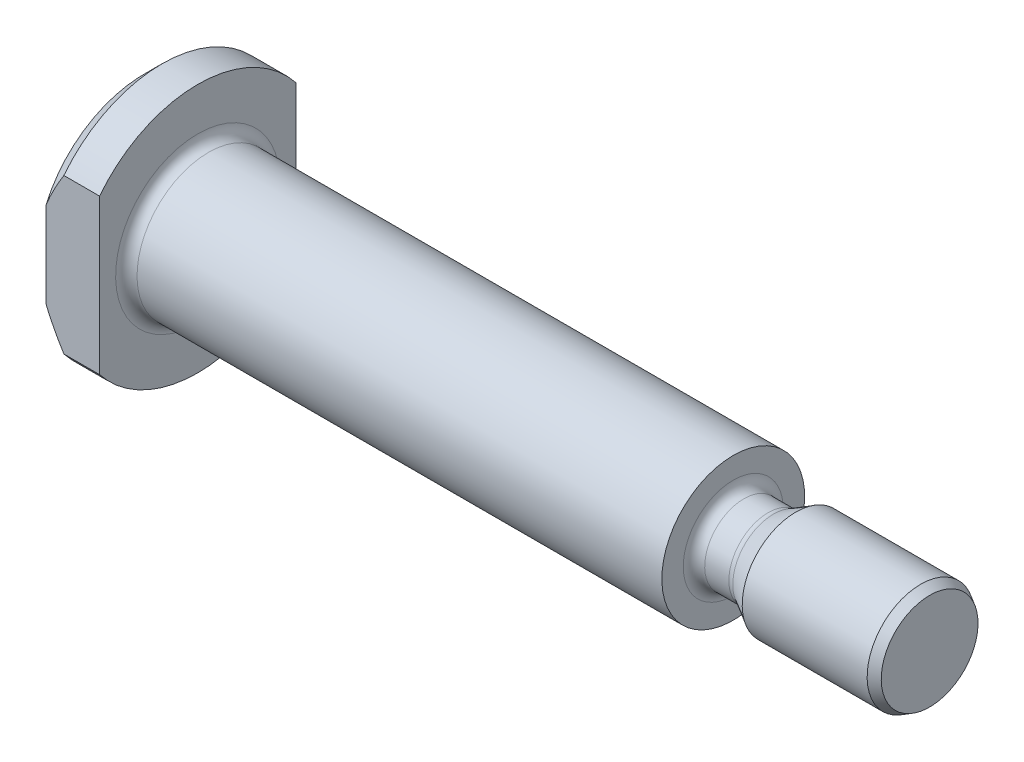
ISO-10303-21;
HEADER;
FILE_DESCRIPTION(('STEP AP214'),'2;1');
FILE_NAME('part.step','',(''),(''),'','','');
FILE_SCHEMA(('AUTOMOTIVE_DESIGN { 1 0 10303 214 1 1 1 1 }'));
ENDSEC;
DATA;
#1=APPLICATION_CONTEXT('core data for automotive mechanical design processes');
#2=APPLICATION_PROTOCOL_DEFINITION('international standard','automotive_design',2000,#1);
#3=PRODUCT_CONTEXT('',#1,'mechanical');
#4=PRODUCT('Part','Part','',(#3));
#5=PRODUCT_RELATED_PRODUCT_CATEGORY('part','',(#4));
#6=PRODUCT_DEFINITION_FORMATION('','',#4);
#7=PRODUCT_DEFINITION_CONTEXT('part definition',#1,'design');
#8=PRODUCT_DEFINITION('design','',#6,#7);
#9=PRODUCT_DEFINITION_SHAPE('','',#8);
#10=(LENGTH_UNIT() NAMED_UNIT(*) SI_UNIT(.MILLI.,.METRE.));
#11=(NAMED_UNIT(*) PLANE_ANGLE_UNIT() SI_UNIT($,.RADIAN.));
#12=(NAMED_UNIT(*) SI_UNIT($,.STERADIAN.) SOLID_ANGLE_UNIT());
#13=UNCERTAINTY_MEASURE_WITH_UNIT(LENGTH_MEASURE(1.E-05),#10,'distance_accuracy_value','');
#14=(GEOMETRIC_REPRESENTATION_CONTEXT(3) GLOBAL_UNCERTAINTY_ASSIGNED_CONTEXT((#13)) GLOBAL_UNIT_ASSIGNED_CONTEXT((#10,
#11,#12)) REPRESENTATION_CONTEXT('',''));
#15=CARTESIAN_POINT('',(0.,0.,0.));
#16=DIRECTION('',(0.,0.,1.));
#17=DIRECTION('',(1.,0.,0.));
#18=AXIS2_PLACEMENT_3D('',#15,#16,#17);
#19=CARTESIAN_POINT('',(-2.,0.,0.));
#20=DIRECTION('',(1.,0.,0.));
#21=DIRECTION('',(0.,1.,0.));
#22=AXIS2_PLACEMENT_3D('',#19,#20,#21);
#23=CONICAL_SURFACE('',#22,7.,0.785398163397453);
#24=CARTESIAN_POINT('',(6.42160130857092,14.407490653147,5.5));
#25=CARTESIAN_POINT('',(6.2140085067097,14.1852819508084,5.5));
#26=CARTESIAN_POINT('',(6.00673759210638,13.9627725748194,5.5));
#27=CARTESIAN_POINT('',(5.59294272838001,13.5170577571821,5.5));
#28=CARTESIAN_POINT('',(5.38641878412843,13.2938523110119,5.5));
#29=CARTESIAN_POINT('',(4.76802946502719,12.6229491346412,5.5));
#30=CARTESIAN_POINT('',(4.35744418424686,12.174068824422,5.5));
#31=CARTESIAN_POINT('',(3.53786235253057,11.2687745060695,5.5));
#32=CARTESIAN_POINT('',(3.1289001823098,10.8123293131101,5.5));
#33=CARTESIAN_POINT('',(2.31760801338081,9.89367818511764,5.5));
#34=CARTESIAN_POINT('',(1.91527707682663,9.43147308122276,5.5));
#35=CARTESIAN_POINT('',(1.19618220466822,8.5878460088273,5.5));
#36=CARTESIAN_POINT('',(0.877750154137123,8.20785299861036,5.5));
#37=CARTESIAN_POINT('',(0.406848077437969,7.6322258845429,5.5));
#38=CARTESIAN_POINT('',(0.250977264883488,7.43937492585583,5.5));
#39=CARTESIAN_POINT('',(-0.0579953263869306,7.05147017764024,5.5));
#40=CARTESIAN_POINT('',(-0.211097169259317,6.85641643932018,5.5));
#41=CARTESIAN_POINT('',(-0.513636295730822,6.46405029072311,5.5));
#42=CARTESIAN_POINT('',(-0.663079770352753,6.26674266473522,5.5));
#43=CARTESIAN_POINT('',(-0.957780610145581,5.86899854365025,5.5));
#44=CARTESIAN_POINT('',(-1.10303773930447,5.66856187312646,5.5));
#45=CARTESIAN_POINT('',(-1.38818099005456,5.26406345187298,5.5));
#46=CARTESIAN_POINT('',(-1.52807016637792,5.06000386252611,5.5));
#47=CARTESIAN_POINT('',(-1.80107254710975,4.64741873676392,5.5));
#48=CARTESIAN_POINT('',(-1.93418681786383,4.43889391054704,5.5));
#49=CARTESIAN_POINT('',(-2.17357773333773,4.04607884891632,5.5));
#50=CARTESIAN_POINT('',(-2.28100037192873,3.86249015927053,5.5));
#51=CARTESIAN_POINT('',(-2.48762947625261,3.49068304014723,5.5));
#52=CARTESIAN_POINT('',(-2.5868350260627,3.30246409758039,5.5));
#53=CARTESIAN_POINT('',(-2.77471130545355,2.92092012148316,5.5));
#54=CARTESIAN_POINT('',(-2.86338768819946,2.72759789671046,5.5));
#55=CARTESIAN_POINT('',(-3.02738792348299,2.33533754710615,5.5));
#56=CARTESIAN_POINT('',(-3.10271516134887,2.1364008609737,5.5));
#57=CARTESIAN_POINT('',(-3.22285600841365,1.77433099137925,5.5));
#58=CARTESIAN_POINT('',(-3.27075919219924,1.6122292684223,5.5));
#59=CARTESIAN_POINT('',(-3.35413707195446,1.28483562680555,5.5));
#60=CARTESIAN_POINT('',(-3.3896133212217,1.11954410957926,5.5));
#61=CARTESIAN_POINT('',(-3.446375195885,0.787063564300932,5.5));
#62=CARTESIAN_POINT('',(-3.46770685756114,0.619882511176268,5.5));
#63=CARTESIAN_POINT('',(-3.49519730580038,0.284265988474489,5.5));
#64=CARTESIAN_POINT('',(-3.50135695656545,0.115830590893377,5.5));
#65=CARTESIAN_POINT('',(-3.49813700396361,-0.221345225546226,5.5));
#66=CARTESIAN_POINT('',(-3.48871531614897,-0.390085236819539,5.5));
#67=CARTESIAN_POINT('',(-3.45480612946066,-0.726032152636526,5.5));
#68=CARTESIAN_POINT('',(-3.43031744666041,-0.893238935655002,5.5));
#69=CARTESIAN_POINT('',(-3.36748663177498,-1.22553284707377,5.5));
#70=CARTESIAN_POINT('',(-3.32910137006628,-1.39061170094238,5.5));
#71=CARTESIAN_POINT('',(-3.24023737331926,-1.71744505034386,5.5));
#72=CARTESIAN_POINT('',(-3.18975806158973,-1.87919938695136,5.5));
#73=CARTESIAN_POINT('',(-3.07214397956246,-2.21753658628967,5.5));
#74=CARTESIAN_POINT('',(-3.00376056891328,-2.39368174103322,5.5));
#75=CARTESIAN_POINT('',(-2.85658629589864,-2.7416058125428,5.5));
#76=CARTESIAN_POINT('',(-2.77779101103977,-2.91338283674539,5.5));
#77=CARTESIAN_POINT('',(-2.61168243105845,-3.25308942305236,5.5));
#78=CARTESIAN_POINT('',(-2.52435522482213,-3.42101213125664,5.5));
#79=CARTESIAN_POINT('',(-2.34293585559918,-3.75311106036371,5.5));
#80=CARTESIAN_POINT('',(-2.24884455389935,-3.91728775475967,5.5));
#81=CARTESIAN_POINT('',(-2.0539183461506,-4.24447106215153,5.5));
#82=CARTESIAN_POINT('',(-1.95301167701299,-4.40743472118666,5.5));
#83=CARTESIAN_POINT('',(-1.74661894816555,-4.73042959478367,5.5));
#84=CARTESIAN_POINT('',(-1.64113278270491,-4.89046074150581,5.5));
#85=CARTESIAN_POINT('',(-1.42651068126443,-5.20781989122457,5.5));
#86=CARTESIAN_POINT('',(-1.31737843488572,-5.36515039674207,5.5));
#87=CARTESIAN_POINT('',(-1.09601093875057,-5.67760427855663,5.5));
#88=CARTESIAN_POINT('',(-0.983775728708914,-5.8327276830639,5.5));
#89=CARTESIAN_POINT('',(-0.728044045271367,-6.17999548085969,5.5));
#90=CARTESIAN_POINT('',(-0.58381046861594,-6.37159649879271,5.5));
#91=CARTESIAN_POINT('',(-0.292051310455661,-6.75227906473529,5.5));
#92=CARTESIAN_POINT('',(-0.14452560143736,-6.94136051470035,5.5));
#93=CARTESIAN_POINT('',(0.302101511377769,-7.50547401062687,5.5));
#94=CARTESIAN_POINT('',(0.605217057100171,-7.87732718369842,5.5));
#95=CARTESIAN_POINT('',(1.21913884085698,-8.6152495203823,5.5));
#96=CARTESIAN_POINT('',(1.52995284458637,-8.9813121778655,5.5));
#97=CARTESIAN_POINT('',(2.15694089027971,-9.7088285353471,5.5));
#98=CARTESIAN_POINT('',(2.47311509487822,-10.0702820949151,5.5));
#99=CARTESIAN_POINT('',(3.08895048218409,-10.7664897146563,5.5));
#100=CARTESIAN_POINT('',(3.38836347091314,-11.1014638621295,5.5));
#101=CARTESIAN_POINT('',(3.98991130525997,-11.7689718708849,5.5));
#102=CARTESIAN_POINT('',(4.29204621821333,-12.1015056714259,5.5));
#103=CARTESIAN_POINT('',(4.897778917605,-12.7638636361991,5.5));
#104=CARTESIAN_POINT('',(5.20137188532613,-13.0936922126691,5.5));
#105=CARTESIAN_POINT('',(5.81028552305453,-13.7517220255694,5.5));
#106=CARTESIAN_POINT('',(6.11560610970259,-14.0799233391067,5.5));
#107=CARTESIAN_POINT('',(6.42160130857092,-14.407490653147,5.5));
#108=B_SPLINE_CURVE_WITH_KNOTS('',3,(#24,#25,#26,#27,#28,#29,#30,#31,#32,#33,#34,#35,#36,#37,
#38,#39,#40,#41,#42,#43,#44,#45,#46,#47,#48,#49,#50,#51,#52,#53,#54,#55,#56,#57,#58,#59,#60,#61,
#62,#63,#64,#65,#66,#67,#68,#69,#70,#71,#72,#73,#74,#75,#76,#77,#78,#79,#80,#81,#82,#83,#84,#85,
#86,#87,#88,#89,#90,#91,#92,#93,#94,#95,#96,#97,#98,#99,#100,#101,#102,#103,#104,#105,#106,
#107),.UNSPECIFIED.,.F.,.F.,(4,2,2,2,2,2,2,2,2,2,2,2,2,2,2,2,2,2,2,2,2,2,2,2,2,2,2,2,2,2,2,2,2,
2,2,2,2,2,2,2,2,4),(0.,0.912273068034191,1.82455207491194,3.64953847698442,5.48806318761207,
7.32632560766893,8.81354070332439,9.55741939129967,10.3012808216237,11.0437815601163,
11.7863240767297,12.5284375724706,13.2704338986952,13.9083923045568,14.5464217254111,
15.1841070208997,15.8216303679645,16.3283102260683,16.8349267293938,17.3398861509143,
17.8448168091398,18.3511134894517,18.8574499583652,19.3653715649804,19.8733173960901,
20.4397628723223,21.0064497270641,21.5740764820514,22.14163108749,22.7165635940297,
23.2915093841157,23.8658900104513,24.4402632886959,25.1596809498623,25.8791265246085,
27.318197363506,28.758784256824,30.1994149376846,31.5472485165904,32.8951155305717,
34.2399509451655,35.5847220143251),.UNSPECIFIED.);
#109=CARTESIAN_POINT('',(-2.,4.33012701892219,5.5));
#110=VERTEX_POINT('',#109);
#111=CARTESIAN_POINT('',(-3.,2.39791576165634,5.5));
#112=VERTEX_POINT('',#111);
#113=EDGE_CURVE('E346',#110,#112,#108,.T.);
#114=ORIENTED_EDGE('',*,*,#113,.F.);
#115=CARTESIAN_POINT('',(-2.,0.,0.));
#116=DIRECTION('',(1.,0.,0.));
#117=DIRECTION('',(0.,1.,0.));
#118=AXIS2_PLACEMENT_3D('',#115,#116,#117);
#119=CIRCLE('',#118,7.);
#120=CARTESIAN_POINT('',(-2.,4.33012701892219,-5.5));
#121=VERTEX_POINT('',#120);
#122=EDGE_CURVE('E102',#121,#110,#119,.T.);
#123=ORIENTED_EDGE('',*,*,#122,.F.);
#124=CARTESIAN_POINT('',(6.42160130857092,-14.407490653147,-5.5));
#125=CARTESIAN_POINT('',(6.2140085067097,-14.1852819508084,-5.5));
#126=CARTESIAN_POINT('',(6.00673759210638,-13.9627725748194,-5.5));
#127=CARTESIAN_POINT('',(5.59294272838001,-13.5170577571821,-5.5));
#128=CARTESIAN_POINT('',(5.38641878412843,-13.2938523110119,-5.5));
#129=CARTESIAN_POINT('',(4.76802946502719,-12.6229491346412,-5.5));
#130=CARTESIAN_POINT('',(4.35744418424686,-12.174068824422,-5.5));
#131=CARTESIAN_POINT('',(3.53786235253057,-11.2687745060695,-5.5));
#132=CARTESIAN_POINT('',(3.1289001823098,-10.8123293131101,-5.5));
#133=CARTESIAN_POINT('',(2.3176080133808,-9.89367818511764,-5.5));
#134=CARTESIAN_POINT('',(1.91527707682662,-9.43147308122276,-5.5));
#135=CARTESIAN_POINT('',(1.19618220466821,-8.5878460088273,-5.5));
#136=CARTESIAN_POINT('',(0.877750154137117,-8.20785299861035,-5.5));
#137=CARTESIAN_POINT('',(0.406848077437961,-7.63222588454289,-5.5));
#138=CARTESIAN_POINT('',(0.25097726488348,-7.43937492585582,-5.5));
#139=CARTESIAN_POINT('',(-0.0579953263869396,-7.05147017764022,-5.5));
#140=CARTESIAN_POINT('',(-0.211097169259327,-6.85641643932017,-5.5));
#141=CARTESIAN_POINT('',(-0.513636295730833,-6.46405029072309,-5.5));
#142=CARTESIAN_POINT('',(-0.663079770352765,-6.26674266473521,-5.5));
#143=CARTESIAN_POINT('',(-0.957780610145593,-5.86899854365023,-5.5));
#144=CARTESIAN_POINT('',(-1.10303773930449,-5.66856187312644,-5.5));
#145=CARTESIAN_POINT('',(-1.38818099005457,-5.26406345187296,-5.5));
#146=CARTESIAN_POINT('',(-1.52807016637794,-5.06000386252609,-5.5));
#147=CARTESIAN_POINT('',(-1.80107254710976,-4.6474187367639,-5.5));
#148=CARTESIAN_POINT('',(-1.93418681786384,-4.43889391054702,-5.5));
#149=CARTESIAN_POINT('',(-2.17357773333774,-4.0460788489163,-5.5));
#150=CARTESIAN_POINT('',(-2.28100037192874,-3.86249015927051,-5.5));
#151=CARTESIAN_POINT('',(-2.48762947625262,-3.49068304014721,-5.5));
#152=CARTESIAN_POINT('',(-2.58683502606271,-3.30246409758037,-5.5));
#153=CARTESIAN_POINT('',(-2.77471130545356,-2.92092012148314,-5.5));
#154=CARTESIAN_POINT('',(-2.86338768819947,-2.72759789671044,-5.5));
#155=CARTESIAN_POINT('',(-3.027387923483,-2.33533754710613,-5.5));
#156=CARTESIAN_POINT('',(-3.10271516134888,-2.13640086097368,-5.5));
#157=CARTESIAN_POINT('',(-3.22285600841366,-1.77433099137923,-5.5));
#158=CARTESIAN_POINT('',(-3.27075919219925,-1.61222926842228,-5.5));
#159=CARTESIAN_POINT('',(-3.35413707195447,-1.28483562680553,-5.5));
#160=CARTESIAN_POINT('',(-3.3896133212217,-1.11954410957924,-5.5));
#161=CARTESIAN_POINT('',(-3.446375195885,-0.787063564300913,-5.5));
#162=CARTESIAN_POINT('',(-3.46770685756114,-0.61988251117625,-5.5));
#163=CARTESIAN_POINT('',(-3.49519730580038,-0.284265988474472,-5.5));
#164=CARTESIAN_POINT('',(-3.50135695656545,-0.11583059089336,-5.5));
#165=CARTESIAN_POINT('',(-3.49813700396361,0.221345225546242,-5.5));
#166=CARTESIAN_POINT('',(-3.48871531614897,0.390085236819555,-5.5));
#167=CARTESIAN_POINT('',(-3.45480612946066,0.726032152636541,-5.5));
#168=CARTESIAN_POINT('',(-3.43031744666041,0.893238935655016,-5.5));
#169=CARTESIAN_POINT('',(-3.36748663177498,1.22553284707378,-5.5));
#170=CARTESIAN_POINT('',(-3.32910137006628,1.39061170094239,-5.5));
#171=CARTESIAN_POINT('',(-3.24023737331926,1.71744505034387,-5.5));
#172=CARTESIAN_POINT('',(-3.18975806158973,1.87919938695137,-5.5));
#173=CARTESIAN_POINT('',(-3.07214397956245,2.21753658628968,-5.5));
#174=CARTESIAN_POINT('',(-3.00376056891327,2.39368174103324,-5.5));
#175=CARTESIAN_POINT('',(-2.85658629589863,2.74160581254282,-5.5));
#176=CARTESIAN_POINT('',(-2.77779101103976,2.91338283674541,-5.5));
#177=CARTESIAN_POINT('',(-2.61168243105844,3.25308942305238,-5.5));
#178=CARTESIAN_POINT('',(-2.52435522482211,3.42101213125666,-5.5));
#179=CARTESIAN_POINT('',(-2.34293585559916,3.75311106036373,-5.5));
#180=CARTESIAN_POINT('',(-2.24884455389934,3.91728775475969,-5.5));
#181=CARTESIAN_POINT('',(-2.05391834615058,4.24447106215155,-5.5));
#182=CARTESIAN_POINT('',(-1.95301167701298,4.40743472118668,-5.5));
#183=CARTESIAN_POINT('',(-1.74661894816554,4.7304295947837,-5.5));
#184=CARTESIAN_POINT('',(-1.6411327827049,4.89046074150584,-5.5));
#185=CARTESIAN_POINT('',(-1.42651068126441,5.2078198912246,-5.5));
#186=CARTESIAN_POINT('',(-1.3173784348857,5.3651503967421,-5.5));
#187=CARTESIAN_POINT('',(-1.09601093875054,5.67760427855666,-5.5));
#188=CARTESIAN_POINT('',(-0.983775728708891,5.83272768306393,-5.5));
#189=CARTESIAN_POINT('',(-0.728044045271342,6.17999548085973,-5.5));
#190=CARTESIAN_POINT('',(-0.583810468615915,6.37159649879274,-5.5));
#191=CARTESIAN_POINT('',(-0.292051310455637,6.75227906473532,-5.5));
#192=CARTESIAN_POINT('',(-0.144525601437336,6.94136051470038,-5.5));
#193=CARTESIAN_POINT('',(0.30210151137779,7.5054740106269,-5.5));
#194=CARTESIAN_POINT('',(0.60521705710019,7.87732718369844,-5.5));
#195=CARTESIAN_POINT('',(1.219138840857,8.61524952038232,-5.5));
#196=CARTESIAN_POINT('',(1.52995284458639,8.98131217786552,-5.5));
#197=CARTESIAN_POINT('',(2.15694089027972,9.70882853534712,-5.5));
#198=CARTESIAN_POINT('',(2.47311509487824,10.0702820949152,-5.5));
#199=CARTESIAN_POINT('',(3.0889504821841,10.7664897146563,-5.5));
#200=CARTESIAN_POINT('',(3.38836347091315,11.1014638621295,-5.5));
#201=CARTESIAN_POINT('',(3.98991130525998,11.7689718708849,-5.5));
#202=CARTESIAN_POINT('',(4.29204621821334,12.1015056714259,-5.5));
#203=CARTESIAN_POINT('',(4.897778917605,12.7638636361991,-5.5));
#204=CARTESIAN_POINT('',(5.20137188532613,13.0936922126691,-5.5));
#205=CARTESIAN_POINT('',(5.81028552305453,13.7517220255693,-5.5));
#206=CARTESIAN_POINT('',(6.11560610970259,14.0799233391067,-5.5));
#207=CARTESIAN_POINT('',(6.42160130857092,14.407490653147,-5.5));
#208=B_SPLINE_CURVE_WITH_KNOTS('',3,(#124,#125,#126,#127,#128,#129,#130,#131,#132,#133,#134,
#135,#136,#137,#138,#139,#140,#141,#142,#143,#144,#145,#146,#147,#148,#149,#150,#151,#152,#153,
#154,#155,#156,#157,#158,#159,#160,#161,#162,#163,#164,#165,#166,#167,#168,#169,#170,#171,#172,
#173,#174,#175,#176,#177,#178,#179,#180,#181,#182,#183,#184,#185,#186,#187,#188,#189,#190,#191,
#192,#193,#194,#195,#196,#197,#198,#199,#200,#201,#202,#203,#204,#205,#206,#207),.UNSPECIFIED.,
.F.,.F.,(4,2,2,2,2,2,2,2,2,2,2,2,2,2,2,2,2,2,2,2,2,2,2,2,2,2,2,2,2,2,2,2,2,2,2,2,2,2,2,2,2,4),
(0.,0.912273068034192,1.82455207491194,3.64953847698442,5.48806318761208,7.32632560766894,
8.8135407033244,9.55741939129969,10.3012808216238,11.0437815601163,11.7863240767298,
12.5284375724707,13.2704338986952,13.9083923045568,14.5464217254111,15.1841070208997,
15.8216303679645,16.3283102260684,16.8349267293939,17.3398861509143,17.8448168091398,
18.3511134894517,18.8574499583652,19.3653715649804,19.8733173960901,20.4397628723224,
21.0064497270642,21.5740764820515,22.14163108749,22.7165635940297,23.2915093841157,
23.8658900104513,24.440263288696,25.1596809498623,25.8791265246085,27.318197363506,
28.758784256824,30.1994149376846,31.5472485165904,32.8951155305717,34.2399509451655,
35.5847220143251),.UNSPECIFIED.);
#209=CARTESIAN_POINT('',(-3.,2.39791576165634,-5.5));
#210=VERTEX_POINT('',#209);
#211=EDGE_CURVE('E87',#210,#121,#208,.T.);
#212=ORIENTED_EDGE('',*,*,#211,.F.);
#213=CARTESIAN_POINT('',(-3.,0.,0.));
#214=DIRECTION('',(1.,0.,0.));
#215=DIRECTION('',(0.,1.,0.));
#216=AXIS2_PLACEMENT_3D('',#213,#214,#215);
#217=CIRCLE('',#216,5.99999999999999);
#218=EDGE_CURVE('E100',#210,#112,#217,.T.);
#219=ORIENTED_EDGE('',*,*,#218,.T.);
#220=EDGE_LOOP('',(#114,#123,#212,#219));
#221=FACE_BOUND('',#220,.T.);
#222=ADVANCED_FACE('F33',(#221),#23,.T.);
#223=CARTESIAN_POINT('',(41.,0.,0.));
#224=DIRECTION('',(1.,0.,0.));
#225=DIRECTION('',(0.,1.,0.));
#226=AXIS2_PLACEMENT_3D('',#223,#224,#225);
#227=CYLINDRICAL_SURFACE('',#226,7.);
#228=DIRECTION('',(1.,0.,0.));
#229=VECTOR('',#228,1.);
#230=CARTESIAN_POINT('',(41.,-4.33012701892219,5.5));
#231=LINE('',#230,#229);
#232=CARTESIAN_POINT('',(-2.,-4.33012701892219,5.5));
#233=VERTEX_POINT('',#232);
#234=CARTESIAN_POINT('',(0.,-4.33012701892219,5.5));
#235=VERTEX_POINT('',#234);
#236=EDGE_CURVE('E56',#233,#235,#231,.T.);
#237=ORIENTED_EDGE('',*,*,#236,.F.);
#238=CARTESIAN_POINT('',(-2.,-4.33012701892219,-5.5));
#239=VERTEX_POINT('',#238);
#240=EDGE_CURVE('E108',#233,#239,#119,.T.);
#241=ORIENTED_EDGE('',*,*,#240,.T.);
#242=DIRECTION('',(1.,0.,0.));
#243=VECTOR('',#242,1.);
#244=CARTESIAN_POINT('',(41.,-4.33012701892219,-5.5));
#245=LINE('',#244,#243);
#246=CARTESIAN_POINT('',(0.,-4.33012701892219,-5.5));
#247=VERTEX_POINT('',#246);
#248=EDGE_CURVE('E103',#247,#239,#245,.F.);
#249=ORIENTED_EDGE('',*,*,#248,.F.);
#250=CARTESIAN_POINT('',(0.,0.,0.));
#251=DIRECTION('',(1.,0.,0.));
#252=DIRECTION('',(0.,1.,0.));
#253=AXIS2_PLACEMENT_3D('',#250,#251,#252);
#254=CIRCLE('',#253,7.);
#255=EDGE_CURVE('E161',#235,#247,#254,.T.);
#256=ORIENTED_EDGE('',*,*,#255,.F.);
#257=EDGE_LOOP('',(#237,#241,#249,#256));
#258=FACE_BOUND('',#257,.T.);
#259=ADVANCED_FACE('F214',(#258),#227,.T.);
#260=CARTESIAN_POINT('',(-3.,0.,0.));
#261=DIRECTION('',(-1.,0.,0.));
#262=DIRECTION('',(0.,-1.,0.));
#263=AXIS2_PLACEMENT_3D('',#260,#261,#262);
#264=PLANE('',#263);
#265=DIRECTION('',(0.,1.,0.));
#266=VECTOR('',#265,1.);
#267=CARTESIAN_POINT('',(-3.,-7.,5.5));
#268=LINE('',#267,#266);
#269=CARTESIAN_POINT('',(-3.,-2.39791576165634,5.5));
#270=VERTEX_POINT('',#269);
#271=EDGE_CURVE('E94',#270,#112,#268,.T.);
#272=ORIENTED_EDGE('',*,*,#271,.T.);
#273=ORIENTED_EDGE('',*,*,#218,.F.);
#274=DIRECTION('',(0.,-1.,0.));
#275=VECTOR('',#274,1.);
#276=CARTESIAN_POINT('',(-3.,-7.,-5.5));
#277=LINE('',#276,#275);
#278=CARTESIAN_POINT('',(-3.,-2.39791576165634,-5.5));
#279=VERTEX_POINT('',#278);
#280=EDGE_CURVE('E84',#210,#279,#277,.T.);
#281=ORIENTED_EDGE('',*,*,#280,.T.);
#282=EDGE_CURVE('E107',#270,#279,#217,.T.);
#283=ORIENTED_EDGE('',*,*,#282,.F.);
#284=EDGE_LOOP('',(#272,#273,#281,#283));
#285=FACE_BOUND('',#284,.T.);
#286=ADVANCED_FACE('F106',(#285),#264,.T.);
#287=EDGE_CURVE('E344',#270,#233,#108,.T.);
#288=ORIENTED_EDGE('',*,*,#287,.F.);
#289=ORIENTED_EDGE('',*,*,#282,.T.);
#290=EDGE_CURVE('E89',#239,#279,#208,.T.);
#291=ORIENTED_EDGE('',*,*,#290,.F.);
#292=ORIENTED_EDGE('',*,*,#240,.F.);
#293=EDGE_LOOP('',(#288,#289,#291,#292));
#294=FACE_BOUND('',#293,.T.);
#295=ADVANCED_FACE('F180',(#294),#23,.T.);
#296=DIRECTION('',(1.,0.,0.));
#297=VECTOR('',#296,1.);
#298=CARTESIAN_POINT('',(41.,4.33012701892219,5.5));
#299=LINE('',#298,#297);
#300=CARTESIAN_POINT('',(0.,4.33012701892219,5.5));
#301=VERTEX_POINT('',#300);
#302=EDGE_CURVE('E169',#301,#110,#299,.F.);
#303=ORIENTED_EDGE('',*,*,#302,.F.);
#304=CARTESIAN_POINT('',(0.,4.33012701892219,-5.5));
#305=VERTEX_POINT('',#304);
#306=EDGE_CURVE('E154',#305,#301,#254,.T.);
#307=ORIENTED_EDGE('',*,*,#306,.F.);
#308=DIRECTION('',(1.,0.,0.));
#309=VECTOR('',#308,1.);
#310=CARTESIAN_POINT('',(41.,4.33012701892219,-5.5));
#311=LINE('',#310,#309);
#312=EDGE_CURVE('E48',#121,#305,#311,.T.);
#313=ORIENTED_EDGE('',*,*,#312,.F.);
#314=ORIENTED_EDGE('',*,*,#122,.T.);
#315=EDGE_LOOP('',(#303,#307,#313,#314));
#316=FACE_BOUND('',#315,.T.);
#317=ADVANCED_FACE('F168',(#316),#227,.T.);
#318=CARTESIAN_POINT('',(0.,7.,0.));
#319=DIRECTION('',(1.,0.,0.));
#320=DIRECTION('',(0.,1.,0.));
#321=AXIS2_PLACEMENT_3D('',#318,#319,#320);
#322=PLANE('',#321);
#323=CARTESIAN_POINT('',(0.,0.,0.));
#324=DIRECTION('',(1.,0.,0.));
#325=DIRECTION('',(0.,1.,0.));
#326=AXIS2_PLACEMENT_3D('',#323,#324,#325);
#327=CIRCLE('',#326,4.6);
#328=CARTESIAN_POINT('',(0.,4.6,0.));
#329=VERTEX_POINT('',#328);
#330=EDGE_CURVE('E121',#329,#329,#327,.F.);
#331=ORIENTED_EDGE('',*,*,#330,.T.);
#332=EDGE_LOOP('',(#331));
#333=FACE_BOUND('',#332,.T.);
#334=DIRECTION('',(0.,1.,0.));
#335=VECTOR('',#334,1.);
#336=CARTESIAN_POINT('',(0.,7.,5.5));
#337=LINE('',#336,#335);
#338=EDGE_CURVE('E116',#235,#301,#337,.T.);
#339=ORIENTED_EDGE('',*,*,#338,.F.);
#340=ORIENTED_EDGE('',*,*,#255,.T.);
#341=DIRECTION('',(0.,-1.,0.));
#342=VECTOR('',#341,1.);
#343=CARTESIAN_POINT('',(0.,7.,-5.5));
#344=LINE('',#343,#342);
#345=EDGE_CURVE('E110',#305,#247,#344,.T.);
#346=ORIENTED_EDGE('',*,*,#345,.F.);
#347=ORIENTED_EDGE('',*,*,#306,.T.);
#348=EDGE_LOOP('',(#339,#340,#346,#347));
#349=FACE_BOUND('',#348,.T.);
#350=ADVANCED_FACE('F209',(#333,#349),#322,.T.);
#351=CARTESIAN_POINT('',(41.,0.,0.));
#352=DIRECTION('',(1.,0.,0.));
#353=DIRECTION('',(0.,1.,0.));
#354=AXIS2_PLACEMENT_3D('',#351,#352,#353);
#355=CYLINDRICAL_SURFACE('',#354,4.);
#356=CARTESIAN_POINT('',(0.600000000000003,0.,0.));
#357=DIRECTION('',(1.,0.,0.));
#358=DIRECTION('',(0.,1.,0.));
#359=AXIS2_PLACEMENT_3D('',#356,#357,#358);
#360=CIRCLE('',#359,4.);
#361=CARTESIAN_POINT('',(0.600000000000003,4.,0.));
#362=VERTEX_POINT('',#361);
#363=EDGE_CURVE('E118',#362,#362,#360,.T.);
#364=ORIENTED_EDGE('',*,*,#363,.T.);
#365=EDGE_LOOP('',(#364));
#366=FACE_BOUND('',#365,.T.);
#367=CARTESIAN_POINT('',(30.,0.,0.));
#368=DIRECTION('',(1.,0.,0.));
#369=DIRECTION('',(0.,1.,0.));
#370=AXIS2_PLACEMENT_3D('',#367,#368,#369);
#371=CIRCLE('',#370,4.);
#372=CARTESIAN_POINT('',(30.,4.,0.));
#373=VERTEX_POINT('',#372);
#374=EDGE_CURVE('E150',#373,#373,#371,.T.);
#375=ORIENTED_EDGE('',*,*,#374,.F.);
#376=EDGE_LOOP('',(#375));
#377=FACE_BOUND('',#376,.T.);
#378=ADVANCED_FACE('F205',(#366,#377),#355,.T.);
#379=CARTESIAN_POINT('',(30.,4.,0.));
#380=DIRECTION('',(1.,0.,0.));
#381=DIRECTION('',(0.,1.,0.));
#382=AXIS2_PLACEMENT_3D('',#379,#380,#381);
#383=PLANE('',#382);
#384=CARTESIAN_POINT('',(30.,0.,0.));
#385=DIRECTION('',(1.,0.,0.));
#386=DIRECTION('',(0.,1.,0.));
#387=AXIS2_PLACEMENT_3D('',#384,#385,#386);
#388=CIRCLE('',#387,2.8);
#389=CARTESIAN_POINT('',(30.,2.8,0.));
#390=VERTEX_POINT('',#389);
#391=EDGE_CURVE('E11',#390,#390,#388,.F.);
#392=ORIENTED_EDGE('',*,*,#391,.T.);
#393=EDGE_LOOP('',(#392));
#394=FACE_BOUND('',#393,.T.);
#395=ORIENTED_EDGE('',*,*,#374,.T.);
#396=EDGE_LOOP('',(#395));
#397=FACE_BOUND('',#396,.T.);
#398=ADVANCED_FACE('F202',(#394,#397),#383,.T.);
#399=CARTESIAN_POINT('',(41.,0.,0.));
#400=DIRECTION('',(1.,0.,0.));
#401=DIRECTION('',(0.,1.,0.));
#402=AXIS2_PLACEMENT_3D('',#399,#400,#401);
#403=CYLINDRICAL_SURFACE('',#402,2.2);
#404=CARTESIAN_POINT('',(31.9535898384862,0.,0.));
#405=DIRECTION('',(1.,0.,0.));
#406=DIRECTION('',(0.,1.,0.));
#407=AXIS2_PLACEMENT_3D('',#404,#405,#406);
#408=CIRCLE('',#407,2.2);
#409=CARTESIAN_POINT('',(31.9535898384862,2.2,0.));
#410=VERTEX_POINT('',#409);
#411=EDGE_CURVE('E41',#410,#410,#408,.F.);
#412=ORIENTED_EDGE('',*,*,#411,.T.);
#413=EDGE_LOOP('',(#412));
#414=FACE_BOUND('',#413,.T.);
#415=CARTESIAN_POINT('',(30.6,0.,0.));
#416=DIRECTION('',(1.,0.,0.));
#417=DIRECTION('',(0.,1.,0.));
#418=AXIS2_PLACEMENT_3D('',#415,#416,#417);
#419=CIRCLE('',#418,2.2);
#420=CARTESIAN_POINT('',(30.6,2.2,0.));
#421=VERTEX_POINT('',#420);
#422=EDGE_CURVE('E127',#421,#421,#419,.T.);
#423=ORIENTED_EDGE('',*,*,#422,.T.);
#424=EDGE_LOOP('',(#423));
#425=FACE_BOUND('',#424,.T.);
#426=ADVANCED_FACE('F132',(#414,#425),#403,.T.);
#427=CARTESIAN_POINT('',(33.5,0.,0.));
#428=DIRECTION('',(1.,0.,0.));
#429=DIRECTION('',(0.,1.,0.));
#430=AXIS2_PLACEMENT_3D('',#427,#428,#429);
#431=CONICAL_SURFACE('',#430,3.,0.5235987755983);
#432=CARTESIAN_POINT('',(32.2535898384862,0.,0.));
#433=DIRECTION('',(1.,0.,0.));
#434=DIRECTION('',(0.,1.,0.));
#435=AXIS2_PLACEMENT_3D('',#432,#433,#434);
#436=CIRCLE('',#435,2.28038475772934);
#437=CARTESIAN_POINT('',(32.2535898384862,2.28038475772934,0.));
#438=VERTEX_POINT('',#437);
#439=EDGE_CURVE('E124',#438,#438,#436,.T.);
#440=ORIENTED_EDGE('',*,*,#439,.T.);
#441=EDGE_LOOP('',(#440));
#442=FACE_BOUND('',#441,.T.);
#443=CARTESIAN_POINT('',(33.5,0.,0.));
#444=DIRECTION('',(1.,0.,0.));
#445=DIRECTION('',(0.,1.,0.));
#446=AXIS2_PLACEMENT_3D('',#443,#444,#445);
#447=CIRCLE('',#446,3.);
#448=CARTESIAN_POINT('',(33.5,3.,0.));
#449=VERTEX_POINT('',#448);
#450=EDGE_CURVE('E148',#449,#449,#447,.T.);
#451=ORIENTED_EDGE('',*,*,#450,.F.);
#452=EDGE_LOOP('',(#451));
#453=FACE_BOUND('',#452,.T.);
#454=ADVANCED_FACE('F141',(#442,#453),#431,.T.);
#455=CARTESIAN_POINT('',(41.,0.,0.));
#456=DIRECTION('',(1.,0.,0.));
#457=DIRECTION('',(0.,1.,0.));
#458=AXIS2_PLACEMENT_3D('',#455,#456,#457);
#459=CYLINDRICAL_SURFACE('',#458,3.);
#460=ORIENTED_EDGE('',*,*,#450,.T.);
#461=EDGE_LOOP('',(#460));
#462=FACE_BOUND('',#461,.T.);
#463=CARTESIAN_POINT('',(40.5,0.,0.));
#464=DIRECTION('',(1.,0.,0.));
#465=DIRECTION('',(0.,1.,0.));
#466=AXIS2_PLACEMENT_3D('',#463,#464,#465);
#467=CIRCLE('',#466,3.);
#468=CARTESIAN_POINT('',(40.5,3.,0.));
#469=VERTEX_POINT('',#468);
#470=EDGE_CURVE('E151',#469,#469,#467,.T.);
#471=ORIENTED_EDGE('',*,*,#470,.F.);
#472=EDGE_LOOP('',(#471));
#473=FACE_BOUND('',#472,.T.);
#474=ADVANCED_FACE('F144',(#462,#473),#459,.T.);
#475=CARTESIAN_POINT('',(41.,0.,0.));
#476=DIRECTION('',(-1.,0.,0.));
#477=DIRECTION('',(0.,-1.,0.));
#478=AXIS2_PLACEMENT_3D('',#475,#476,#477);
#479=CONICAL_SURFACE('',#478,2.71132486540518,0.523598775598311);
#480=ORIENTED_EDGE('',*,*,#470,.T.);
#481=EDGE_LOOP('',(#480));
#482=FACE_BOUND('',#481,.T.);
#483=CARTESIAN_POINT('',(41.,0.,0.));
#484=DIRECTION('',(1.,0.,0.));
#485=DIRECTION('',(0.,1.,0.));
#486=AXIS2_PLACEMENT_3D('',#483,#484,#485);
#487=CIRCLE('',#486,2.71132486540518);
#488=CARTESIAN_POINT('',(41.,2.71132486540518,0.));
#489=VERTEX_POINT('',#488);
#490=EDGE_CURVE('E157',#489,#489,#487,.T.);
#491=ORIENTED_EDGE('',*,*,#490,.F.);
#492=EDGE_LOOP('',(#491));
#493=FACE_BOUND('',#492,.T.);
#494=ADVANCED_FACE('F193',(#482,#493),#479,.T.);
#495=CARTESIAN_POINT('',(41.,0.,0.));
#496=DIRECTION('',(1.,0.,0.));
#497=DIRECTION('',(0.,1.,0.));
#498=AXIS2_PLACEMENT_3D('',#495,#496,#497);
#499=PLANE('',#498);
#500=ORIENTED_EDGE('',*,*,#490,.T.);
#501=EDGE_LOOP('',(#500));
#502=FACE_BOUND('',#501,.T.);
#503=ADVANCED_FACE('F189',(#502),#499,.T.);
#504=CARTESIAN_POINT('',(-17.0801278403287,-7.,-5.5));
#505=DIRECTION('',(0.,0.,1.));
#506=DIRECTION('',(1.,0.,0.));
#507=AXIS2_PLACEMENT_3D('',#504,#505,#506);
#508=PLANE('',#507);
#509=ORIENTED_EDGE('',*,*,#290,.T.);
#510=ORIENTED_EDGE('',*,*,#280,.F.);
#511=ORIENTED_EDGE('',*,*,#211,.T.);
#512=ORIENTED_EDGE('',*,*,#312,.T.);
#513=ORIENTED_EDGE('',*,*,#345,.T.);
#514=ORIENTED_EDGE('',*,*,#248,.T.);
#515=EDGE_LOOP('',(#509,#510,#511,#512,#513,#514));
#516=FACE_BOUND('',#515,.T.);
#517=ADVANCED_FACE('F86',(#516),#508,.F.);
#518=CARTESIAN_POINT('',(-17.0801278403287,-7.,5.5));
#519=DIRECTION('',(0.,0.,-1.));
#520=DIRECTION('',(-1.,0.,0.));
#521=AXIS2_PLACEMENT_3D('',#518,#519,#520);
#522=PLANE('',#521);
#523=ORIENTED_EDGE('',*,*,#113,.T.);
#524=ORIENTED_EDGE('',*,*,#271,.F.);
#525=ORIENTED_EDGE('',*,*,#287,.T.);
#526=ORIENTED_EDGE('',*,*,#236,.T.);
#527=ORIENTED_EDGE('',*,*,#338,.T.);
#528=ORIENTED_EDGE('',*,*,#302,.T.);
#529=EDGE_LOOP('',(#523,#524,#525,#526,#527,#528));
#530=FACE_BOUND('',#529,.T.);
#531=ADVANCED_FACE('F188',(#530),#522,.F.);
#532=CARTESIAN_POINT('',(0.600000000000003,0.,0.));
#533=DIRECTION('',(1.,0.,0.));
#534=DIRECTION('',(0.,1.,0.));
#535=AXIS2_PLACEMENT_3D('',#532,#533,#534);
#536=TOROIDAL_SURFACE('',#535,4.6,0.6);
#537=ORIENTED_EDGE('',*,*,#330,.F.);
#538=EDGE_LOOP('',(#537));
#539=FACE_BOUND('',#538,.T.);
#540=ORIENTED_EDGE('',*,*,#363,.F.);
#541=EDGE_LOOP('',(#540));
#542=FACE_BOUND('',#541,.T.);
#543=ADVANCED_FACE('F138',(#539,#542),#536,.F.);
#544=CARTESIAN_POINT('',(31.9535898384862,0.,0.));
#545=DIRECTION('',(1.,0.,0.));
#546=DIRECTION('',(0.,1.,0.));
#547=AXIS2_PLACEMENT_3D('',#544,#545,#546);
#548=TOROIDAL_SURFACE('',#547,2.8,0.6);
#549=ORIENTED_EDGE('',*,*,#411,.F.);
#550=EDGE_LOOP('',(#549));
#551=FACE_BOUND('',#550,.T.);
#552=ORIENTED_EDGE('',*,*,#439,.F.);
#553=EDGE_LOOP('',(#552));
#554=FACE_BOUND('',#553,.T.);
#555=ADVANCED_FACE('F135',(#551,#554),#548,.F.);
#556=CARTESIAN_POINT('',(30.6,0.,0.));
#557=DIRECTION('',(1.,0.,0.));
#558=DIRECTION('',(0.,1.,0.));
#559=AXIS2_PLACEMENT_3D('',#556,#557,#558);
#560=TOROIDAL_SURFACE('',#559,2.8,0.6);
#561=ORIENTED_EDGE('',*,*,#391,.F.);
#562=EDGE_LOOP('',(#561));
#563=FACE_BOUND('',#562,.T.);
#564=ORIENTED_EDGE('',*,*,#422,.F.);
#565=EDGE_LOOP('',(#564));
#566=FACE_BOUND('',#565,.T.);
#567=ADVANCED_FACE('F35',(#563,#566),#560,.F.);
#568=CLOSED_SHELL('',(#222,#259,#286,#295,#317,#350,#378,#398,#426,#454,#474,#494,#503,#517,
#531,#543,#555,#567));
#569=MANIFOLD_SOLID_BREP('B2',#568);
#570=ADVANCED_BREP_SHAPE_REPRESENTATION('',(#18,#569),#14);
#571=SHAPE_DEFINITION_REPRESENTATION(#9,#570);
ENDSEC;
END-ISO-10303-21;
